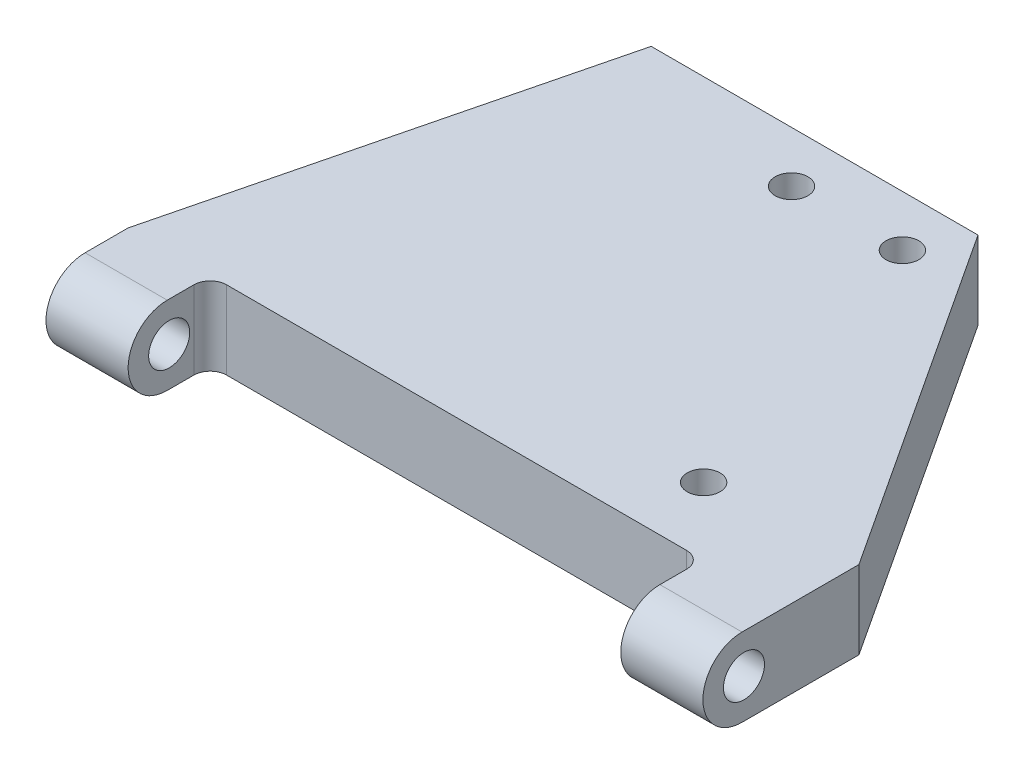
ISO-10303-21;
HEADER;
FILE_DESCRIPTION(('STEP AP214'),'2;1');
FILE_NAME('part.step','',(''),(''),'','','');
FILE_SCHEMA(('AUTOMOTIVE_DESIGN { 1 0 10303 214 1 1 1 1 }'));
ENDSEC;
DATA;
#1=APPLICATION_CONTEXT('core data for automotive mechanical design processes');
#2=APPLICATION_PROTOCOL_DEFINITION('international standard','automotive_design',2000,#1);
#3=PRODUCT_CONTEXT('',#1,'mechanical');
#4=PRODUCT('Part','Part','',(#3));
#5=PRODUCT_RELATED_PRODUCT_CATEGORY('part','',(#4));
#6=PRODUCT_DEFINITION_FORMATION('','',#4);
#7=PRODUCT_DEFINITION_CONTEXT('part definition',#1,'design');
#8=PRODUCT_DEFINITION('design','',#6,#7);
#9=PRODUCT_DEFINITION_SHAPE('','',#8);
#10=(LENGTH_UNIT() NAMED_UNIT(*) SI_UNIT(.MILLI.,.METRE.));
#11=(NAMED_UNIT(*) PLANE_ANGLE_UNIT() SI_UNIT($,.RADIAN.));
#12=(NAMED_UNIT(*) SI_UNIT($,.STERADIAN.) SOLID_ANGLE_UNIT());
#13=UNCERTAINTY_MEASURE_WITH_UNIT(LENGTH_MEASURE(1.E-05),#10,'distance_accuracy_value','');
#14=(GEOMETRIC_REPRESENTATION_CONTEXT(3) GLOBAL_UNCERTAINTY_ASSIGNED_CONTEXT((#13)) GLOBAL_UNIT_ASSIGNED_CONTEXT((#10,
#11,#12)) REPRESENTATION_CONTEXT('',''));
#15=CARTESIAN_POINT('',(0.,0.,0.));
#16=DIRECTION('',(0.,0.,1.));
#17=DIRECTION('',(1.,0.,0.));
#18=AXIS2_PLACEMENT_3D('',#15,#16,#17);
#19=CARTESIAN_POINT('',(140.,9.525,112.475));
#20=DIRECTION('',(1.,0.,0.));
#21=DIRECTION('',(0.,0.,-1.));
#22=AXIS2_PLACEMENT_3D('',#19,#20,#21);
#23=CYLINDRICAL_SURFACE('',#22,9.525);
#24=DIRECTION('',(-1.,0.,0.));
#25=VECTOR('',#24,1.);
#26=CARTESIAN_POINT('',(140.,19.05,112.475));
#27=LINE('',#26,#25);
#28=CARTESIAN_POINT('',(140.,19.05,112.475));
#29=VERTEX_POINT('',#28);
#30=CARTESIAN_POINT('',(160.,19.05,112.475));
#31=VERTEX_POINT('',#30);
#32=EDGE_CURVE('E293',#29,#31,#27,.F.);
#33=ORIENTED_EDGE('',*,*,#32,.F.);
#34=CARTESIAN_POINT('',(140.,9.525,112.475));
#35=DIRECTION('',(1.,0.,0.));
#36=DIRECTION('',(0.,0.,-1.));
#37=AXIS2_PLACEMENT_3D('',#34,#35,#36);
#38=CIRCLE('',#37,9.525);
#39=CARTESIAN_POINT('',(140.,0.,112.475));
#40=VERTEX_POINT('',#39);
#41=EDGE_CURVE('E118',#40,#29,#38,.F.);
#42=ORIENTED_EDGE('',*,*,#41,.F.);
#43=DIRECTION('',(1.,0.,0.));
#44=VECTOR('',#43,1.);
#45=CARTESIAN_POINT('',(0.,0.,112.475));
#46=LINE('',#45,#44);
#47=CARTESIAN_POINT('',(160.,0.,112.475));
#48=VERTEX_POINT('',#47);
#49=EDGE_CURVE('E296',#48,#40,#46,.F.);
#50=ORIENTED_EDGE('',*,*,#49,.F.);
#51=CARTESIAN_POINT('',(160.,9.525,112.475));
#52=DIRECTION('',(-1.,0.,0.));
#53=DIRECTION('',(0.,0.,1.));
#54=AXIS2_PLACEMENT_3D('',#51,#52,#53);
#55=CIRCLE('',#54,9.525);
#56=EDGE_CURVE('E12',#31,#48,#55,.F.);
#57=ORIENTED_EDGE('',*,*,#56,.F.);
#58=EDGE_LOOP('',(#33,#42,#50,#57));
#59=FACE_BOUND('',#58,.T.);
#60=ADVANCED_FACE('F110',(#59),#23,.T.);
#61=CARTESIAN_POINT('',(0.,9.525,112.475));
#62=DIRECTION('',(1.,0.,0.));
#63=DIRECTION('',(0.,0.,-1.));
#64=AXIS2_PLACEMENT_3D('',#61,#62,#63);
#65=CYLINDRICAL_SURFACE('',#64,9.525);
#66=DIRECTION('',(-1.,0.,0.));
#67=VECTOR('',#66,1.);
#68=CARTESIAN_POINT('',(0.,19.05,112.475));
#69=LINE('',#68,#67);
#70=CARTESIAN_POINT('',(0.,19.05,112.475));
#71=VERTEX_POINT('',#70);
#72=CARTESIAN_POINT('',(20.,19.05,112.475));
#73=VERTEX_POINT('',#72);
#74=EDGE_CURVE('E207',#71,#73,#69,.F.);
#75=ORIENTED_EDGE('',*,*,#74,.F.);
#76=CARTESIAN_POINT('',(0.,9.525,112.475));
#77=DIRECTION('',(1.,0.,0.));
#78=DIRECTION('',(0.,0.,-1.));
#79=AXIS2_PLACEMENT_3D('',#76,#77,#78);
#80=CIRCLE('',#79,9.525);
#81=CARTESIAN_POINT('',(0.,0.,112.475));
#82=VERTEX_POINT('',#81);
#83=EDGE_CURVE('E289',#82,#71,#80,.F.);
#84=ORIENTED_EDGE('',*,*,#83,.F.);
#85=DIRECTION('',(1.,0.,0.));
#86=VECTOR('',#85,1.);
#87=CARTESIAN_POINT('',(0.,0.,112.475));
#88=LINE('',#87,#86);
#89=CARTESIAN_POINT('',(20.,0.,112.475));
#90=VERTEX_POINT('',#89);
#91=EDGE_CURVE('E286',#90,#82,#88,.F.);
#92=ORIENTED_EDGE('',*,*,#91,.F.);
#93=CARTESIAN_POINT('',(20.,9.525,112.475));
#94=DIRECTION('',(1.,0.,0.));
#95=DIRECTION('',(0.,0.,-1.));
#96=AXIS2_PLACEMENT_3D('',#93,#94,#95);
#97=CIRCLE('',#96,9.525);
#98=EDGE_CURVE('E291',#73,#90,#97,.T.);
#99=ORIENTED_EDGE('',*,*,#98,.F.);
#100=EDGE_LOOP('',(#75,#84,#92,#99));
#101=FACE_BOUND('',#100,.T.);
#102=ADVANCED_FACE('F331',(#101),#65,.T.);
#103=CARTESIAN_POINT('',(0.,0.,0.));
#104=DIRECTION('',(0.,1.,0.));
#105=DIRECTION('',(0.,0.,1.));
#106=AXIS2_PLACEMENT_3D('',#103,#104,#105);
#107=PLANE('',#106);
#108=CARTESIAN_POINT('',(123.750569229122,0.,85.5773374277373));
#109=DIRECTION('',(0.,1.,0.));
#110=DIRECTION('',(0.,0.,1.));
#111=AXIS2_PLACEMENT_3D('',#108,#109,#110);
#112=CIRCLE('',#111,3.99999999999995);
#113=CARTESIAN_POINT('',(123.750569229122,0.,89.5773374277373));
#114=VERTEX_POINT('',#113);
#115=EDGE_CURVE('E436',#114,#114,#112,.T.);
#116=ORIENTED_EDGE('',*,*,#115,.T.);
#117=EDGE_LOOP('',(#116));
#118=FACE_BOUND('',#117,.T.);
#119=CARTESIAN_POINT('',(72.,0.,12.4141568321594));
#120=DIRECTION('',(0.,-1.,0.));
#121=DIRECTION('',(0.,0.,-1.));
#122=AXIS2_PLACEMENT_3D('',#119,#120,#121);
#123=CIRCLE('',#122,4.00000000000001);
#124=CARTESIAN_POINT('',(72.,0.,8.41415683215943));
#125=VERTEX_POINT('',#124);
#126=EDGE_CURVE('E445',#125,#125,#123,.T.);
#127=ORIENTED_EDGE('',*,*,#126,.F.);
#128=EDGE_LOOP('',(#127));
#129=FACE_BOUND('',#128,.T.);
#130=CARTESIAN_POINT('',(99.,0.,12.4141568321594));
#131=DIRECTION('',(0.,-1.,0.));
#132=DIRECTION('',(0.,0.,-1.));
#133=AXIS2_PLACEMENT_3D('',#130,#131,#132);
#134=CIRCLE('',#133,4.00000000000001);
#135=CARTESIAN_POINT('',(99.,0.,8.41415683215943));
#136=VERTEX_POINT('',#135);
#137=EDGE_CURVE('E395',#136,#136,#134,.T.);
#138=ORIENTED_EDGE('',*,*,#137,.F.);
#139=EDGE_LOOP('',(#138));
#140=FACE_BOUND('',#139,.T.);
#141=DIRECTION('',(0.,0.,-1.));
#142=VECTOR('',#141,1.);
#143=CARTESIAN_POINT('',(160.,0.,1.1686558153949E-13));
#144=LINE('',#143,#142);
#145=CARTESIAN_POINT('',(160.,0.,84.));
#146=VERTEX_POINT('',#145);
#147=EDGE_CURVE('E255',#48,#146,#144,.T.);
#148=ORIENTED_EDGE('',*,*,#147,.F.);
#149=ORIENTED_EDGE('',*,*,#49,.T.);
#150=DIRECTION('',(0.,0.,1.));
#151=VECTOR('',#150,1.);
#152=CARTESIAN_POINT('',(140.,0.,2.42861286636753E-13));
#153=LINE('',#152,#151);
#154=CARTESIAN_POINT('',(140.,0.,106.));
#155=VERTEX_POINT('',#154);
#156=EDGE_CURVE('E252',#155,#40,#153,.T.);
#157=ORIENTED_EDGE('',*,*,#156,.F.);
#158=CARTESIAN_POINT('',(136.,0.,106.));
#159=DIRECTION('',(0.,1.,0.));
#160=DIRECTION('',(0.,0.,1.));
#161=AXIS2_PLACEMENT_3D('',#158,#159,#160);
#162=CIRCLE('',#161,4.00000000000001);
#163=CARTESIAN_POINT('',(136.,0.,102.));
#164=VERTEX_POINT('',#163);
#165=EDGE_CURVE('E249',#164,#155,#162,.F.);
#166=ORIENTED_EDGE('',*,*,#165,.F.);
#167=DIRECTION('',(-1.,0.,0.));
#168=VECTOR('',#167,1.);
#169=CARTESIAN_POINT('',(0.,0.,102.));
#170=LINE('',#169,#168);
#171=CARTESIAN_POINT('',(24.,0.,102.));
#172=VERTEX_POINT('',#171);
#173=EDGE_CURVE('E246',#164,#172,#170,.T.);
#174=ORIENTED_EDGE('',*,*,#173,.T.);
#175=CARTESIAN_POINT('',(24.,0.,106.));
#176=DIRECTION('',(0.,1.,0.));
#177=DIRECTION('',(0.,0.,1.));
#178=AXIS2_PLACEMENT_3D('',#175,#176,#177);
#179=CIRCLE('',#178,4.00000000000001);
#180=CARTESIAN_POINT('',(20.,0.,106.));
#181=VERTEX_POINT('',#180);
#182=EDGE_CURVE('E202',#172,#181,#179,.T.);
#183=ORIENTED_EDGE('',*,*,#182,.T.);
#184=DIRECTION('',(0.,0.,1.));
#185=VECTOR('',#184,1.);
#186=CARTESIAN_POINT('',(20.,0.,0.));
#187=LINE('',#186,#185);
#188=EDGE_CURVE('E219',#181,#90,#187,.T.);
#189=ORIENTED_EDGE('',*,*,#188,.T.);
#190=ORIENTED_EDGE('',*,*,#91,.T.);
#191=DIRECTION('',(0.,0.,1.));
#192=VECTOR('',#191,1.);
#193=CARTESIAN_POINT('',(0.,0.,0.));
#194=LINE('',#193,#192);
#195=CARTESIAN_POINT('',(0.,0.,102.));
#196=VERTEX_POINT('',#195);
#197=EDGE_CURVE('E266',#196,#82,#194,.T.);
#198=ORIENTED_EDGE('',*,*,#197,.F.);
#199=DIRECTION('',(0.241640143717287,0.,-0.97036593146312));
#200=VECTOR('',#199,1.);
#201=CARTESIAN_POINT('',(23.9168950399849,0.,5.95577582368252));
#202=LINE('',#201,#200);
#203=CARTESIAN_POINT('',(25.4,0.,0.));
#204=VERTEX_POINT('',#203);
#205=EDGE_CURVE('E263',#196,#204,#202,.T.);
#206=ORIENTED_EDGE('',*,*,#205,.T.);
#207=DIRECTION('',(-1.,0.,0.));
#208=VECTOR('',#207,1.);
#209=CARTESIAN_POINT('',(0.,0.,0.));
#210=LINE('',#209,#208);
#211=CARTESIAN_POINT('',(105.,0.,0.));
#212=VERTEX_POINT('',#211);
#213=EDGE_CURVE('E260',#212,#204,#210,.T.);
#214=ORIENTED_EDGE('',*,*,#213,.F.);
#215=DIRECTION('',(0.547785941363776,0.,0.836618528628312));
#216=VECTOR('',#215,1.);
#217=CARTESIAN_POINT('',(73.4927090566412,0.,-48.1202261680389));
#218=LINE('',#217,#216);
#219=EDGE_CURVE('E257',#212,#146,#218,.T.);
#220=ORIENTED_EDGE('',*,*,#219,.T.);
#221=EDGE_LOOP('',(#148,#149,#157,#166,#174,#183,#189,#190,#198,#206,#214,#220));
#222=FACE_BOUND('',#221,.T.);
#223=ADVANCED_FACE('F305',(#118,#129,#140,#222),#107,.F.);
#224=CARTESIAN_POINT('',(140.,19.05,2.42861286636753E-13));
#225=DIRECTION('',(1.,0.,0.));
#226=DIRECTION('',(0.,0.,-1.));
#227=AXIS2_PLACEMENT_3D('',#224,#225,#226);
#228=PLANE('',#227);
#229=CARTESIAN_POINT('',(140.,9.525,112.));
#230=DIRECTION('',(1.,0.,0.));
#231=DIRECTION('',(0.,0.,-1.));
#232=AXIS2_PLACEMENT_3D('',#229,#230,#231);
#233=CIRCLE('',#232,5.);
#234=CARTESIAN_POINT('',(140.,9.525,107.));
#235=VERTEX_POINT('',#234);
#236=EDGE_CURVE('E389',#235,#235,#233,.T.);
#237=ORIENTED_EDGE('',*,*,#236,.T.);
#238=EDGE_LOOP('',(#237));
#239=FACE_BOUND('',#238,.T.);
#240=ORIENTED_EDGE('',*,*,#156,.T.);
#241=ORIENTED_EDGE('',*,*,#41,.T.);
#242=DIRECTION('',(0.,0.,1.));
#243=VECTOR('',#242,1.);
#244=CARTESIAN_POINT('',(140.,19.05,2.42861286636753E-13));
#245=LINE('',#244,#243);
#246=CARTESIAN_POINT('',(140.,19.05,106.));
#247=VERTEX_POINT('',#246);
#248=EDGE_CURVE('E225',#247,#29,#245,.T.);
#249=ORIENTED_EDGE('',*,*,#248,.F.);
#250=DIRECTION('',(0.,-1.,0.));
#251=VECTOR('',#250,1.);
#252=CARTESIAN_POINT('',(140.,19.05,106.));
#253=LINE('',#252,#251);
#254=EDGE_CURVE('E281',#247,#155,#253,.T.);
#255=ORIENTED_EDGE('',*,*,#254,.T.);
#256=EDGE_LOOP('',(#240,#241,#249,#255));
#257=FACE_BOUND('',#256,.T.);
#258=ADVANCED_FACE('F298',(#239,#257),#228,.F.);
#259=CARTESIAN_POINT('',(136.,19.05,106.));
#260=DIRECTION('',(0.,-1.,0.));
#261=DIRECTION('',(0.,0.,-1.));
#262=AXIS2_PLACEMENT_3D('',#259,#260,#261);
#263=CYLINDRICAL_SURFACE('',#262,4.00000000000001);
#264=ORIENTED_EDGE('',*,*,#165,.T.);
#265=ORIENTED_EDGE('',*,*,#254,.F.);
#266=CARTESIAN_POINT('',(136.,19.05,106.));
#267=DIRECTION('',(0.,1.,0.));
#268=DIRECTION('',(0.,0.,1.));
#269=AXIS2_PLACEMENT_3D('',#266,#267,#268);
#270=CIRCLE('',#269,4.00000000000001);
#271=CARTESIAN_POINT('',(136.,19.05,102.));
#272=VERTEX_POINT('',#271);
#273=EDGE_CURVE('E223',#272,#247,#270,.F.);
#274=ORIENTED_EDGE('',*,*,#273,.F.);
#275=DIRECTION('',(0.,-1.,0.));
#276=VECTOR('',#275,1.);
#277=CARTESIAN_POINT('',(136.,19.05,102.));
#278=LINE('',#277,#276);
#279=EDGE_CURVE('E208',#272,#164,#278,.T.);
#280=ORIENTED_EDGE('',*,*,#279,.T.);
#281=EDGE_LOOP('',(#264,#265,#274,#280));
#282=FACE_BOUND('',#281,.T.);
#283=ADVANCED_FACE('F301',(#282),#263,.F.);
#284=CARTESIAN_POINT('',(0.,19.05,102.));
#285=DIRECTION('',(0.,0.,1.));
#286=DIRECTION('',(1.,0.,0.));
#287=AXIS2_PLACEMENT_3D('',#284,#285,#286);
#288=PLANE('',#287);
#289=ORIENTED_EDGE('',*,*,#173,.F.);
#290=ORIENTED_EDGE('',*,*,#279,.F.);
#291=DIRECTION('',(-1.,0.,0.));
#292=VECTOR('',#291,1.);
#293=CARTESIAN_POINT('',(0.,19.05,102.));
#294=LINE('',#293,#292);
#295=CARTESIAN_POINT('',(24.,19.05,102.));
#296=VERTEX_POINT('',#295);
#297=EDGE_CURVE('E215',#272,#296,#294,.T.);
#298=ORIENTED_EDGE('',*,*,#297,.T.);
#299=DIRECTION('',(0.,-1.,0.));
#300=VECTOR('',#299,1.);
#301=CARTESIAN_POINT('',(24.,19.05,102.));
#302=LINE('',#301,#300);
#303=EDGE_CURVE('E196',#296,#172,#302,.T.);
#304=ORIENTED_EDGE('',*,*,#303,.T.);
#305=EDGE_LOOP('',(#289,#290,#298,#304));
#306=FACE_BOUND('',#305,.T.);
#307=ADVANCED_FACE('F221',(#306),#288,.T.);
#308=CARTESIAN_POINT('',(24.,19.05,106.));
#309=DIRECTION('',(0.,-1.,0.));
#310=DIRECTION('',(0.,0.,-1.));
#311=AXIS2_PLACEMENT_3D('',#308,#309,#310);
#312=CYLINDRICAL_SURFACE('',#311,4.00000000000001);
#313=ORIENTED_EDGE('',*,*,#182,.F.);
#314=ORIENTED_EDGE('',*,*,#303,.F.);
#315=CARTESIAN_POINT('',(24.,19.05,106.));
#316=DIRECTION('',(0.,1.,0.));
#317=DIRECTION('',(0.,0.,1.));
#318=AXIS2_PLACEMENT_3D('',#315,#316,#317);
#319=CIRCLE('',#318,4.00000000000001);
#320=CARTESIAN_POINT('',(20.,19.05,106.));
#321=VERTEX_POINT('',#320);
#322=EDGE_CURVE('E199',#296,#321,#319,.T.);
#323=ORIENTED_EDGE('',*,*,#322,.T.);
#324=DIRECTION('',(0.,-1.,0.));
#325=VECTOR('',#324,1.);
#326=CARTESIAN_POINT('',(20.,19.05,106.));
#327=LINE('',#326,#325);
#328=EDGE_CURVE('E244',#321,#181,#327,.T.);
#329=ORIENTED_EDGE('',*,*,#328,.T.);
#330=EDGE_LOOP('',(#313,#314,#323,#329));
#331=FACE_BOUND('',#330,.T.);
#332=ADVANCED_FACE('F198',(#331),#312,.F.);
#333=CARTESIAN_POINT('',(20.,19.05,0.));
#334=DIRECTION('',(1.,0.,0.));
#335=DIRECTION('',(0.,0.,-1.));
#336=AXIS2_PLACEMENT_3D('',#333,#334,#335);
#337=PLANE('',#336);
#338=CARTESIAN_POINT('',(20.,9.525,112.));
#339=DIRECTION('',(1.,0.,0.));
#340=DIRECTION('',(0.,0.,-1.));
#341=AXIS2_PLACEMENT_3D('',#338,#339,#340);
#342=CIRCLE('',#341,5.);
#343=CARTESIAN_POINT('',(20.,9.525,107.));
#344=VERTEX_POINT('',#343);
#345=EDGE_CURVE('E385',#344,#344,#342,.T.);
#346=ORIENTED_EDGE('',*,*,#345,.F.);
#347=EDGE_LOOP('',(#346));
#348=FACE_BOUND('',#347,.T.);
#349=DIRECTION('',(0.,0.,1.));
#350=VECTOR('',#349,1.);
#351=CARTESIAN_POINT('',(20.,19.05,0.));
#352=LINE('',#351,#350);
#353=EDGE_CURVE('E218',#321,#73,#352,.T.);
#354=ORIENTED_EDGE('',*,*,#353,.T.);
#355=ORIENTED_EDGE('',*,*,#98,.T.);
#356=ORIENTED_EDGE('',*,*,#188,.F.);
#357=ORIENTED_EDGE('',*,*,#328,.F.);
#358=EDGE_LOOP('',(#354,#355,#356,#357));
#359=FACE_BOUND('',#358,.T.);
#360=ADVANCED_FACE('F328',(#348,#359),#337,.T.);
#361=CARTESIAN_POINT('',(0.,19.05,0.));
#362=DIRECTION('',(1.,0.,0.));
#363=DIRECTION('',(0.,0.,-1.));
#364=AXIS2_PLACEMENT_3D('',#361,#362,#363);
#365=PLANE('',#364);
#366=CARTESIAN_POINT('',(0.,9.525,112.));
#367=DIRECTION('',(-1.,0.,0.));
#368=DIRECTION('',(0.,0.,1.));
#369=AXIS2_PLACEMENT_3D('',#366,#367,#368);
#370=CIRCLE('',#369,5.);
#371=CARTESIAN_POINT('',(0.,9.525,117.));
#372=VERTEX_POINT('',#371);
#373=EDGE_CURVE('E386',#372,#372,#370,.T.);
#374=ORIENTED_EDGE('',*,*,#373,.F.);
#375=EDGE_LOOP('',(#374));
#376=FACE_BOUND('',#375,.T.);
#377=ORIENTED_EDGE('',*,*,#197,.T.);
#378=ORIENTED_EDGE('',*,*,#83,.T.);
#379=DIRECTION('',(0.,0.,1.));
#380=VECTOR('',#379,1.);
#381=CARTESIAN_POINT('',(0.,19.05,0.));
#382=LINE('',#381,#380);
#383=CARTESIAN_POINT('',(0.,19.05,102.));
#384=VERTEX_POINT('',#383);
#385=EDGE_CURVE('E240',#384,#71,#382,.T.);
#386=ORIENTED_EDGE('',*,*,#385,.F.);
#387=DIRECTION('',(0.,-1.,0.));
#388=VECTOR('',#387,1.);
#389=CARTESIAN_POINT('',(0.,19.05,102.));
#390=LINE('',#389,#388);
#391=EDGE_CURVE('E272',#384,#196,#390,.T.);
#392=ORIENTED_EDGE('',*,*,#391,.T.);
#393=EDGE_LOOP('',(#377,#378,#386,#392));
#394=FACE_BOUND('',#393,.T.);
#395=ADVANCED_FACE('F324',(#376,#394),#365,.F.);
#396=CARTESIAN_POINT('',(23.9168950399849,19.05,5.95577582368252));
#397=DIRECTION('',(-0.97036593146312,0.,-0.241640143717287));
#398=DIRECTION('',(-0.241640143717287,0.,0.97036593146312));
#399=AXIS2_PLACEMENT_3D('',#396,#397,#398);
#400=PLANE('',#399);
#401=ORIENTED_EDGE('',*,*,#205,.F.);
#402=ORIENTED_EDGE('',*,*,#391,.F.);
#403=DIRECTION('',(0.241640143717287,0.,-0.97036593146312));
#404=VECTOR('',#403,1.);
#405=CARTESIAN_POINT('',(23.9168950399849,19.05,5.95577582368252));
#406=LINE('',#405,#404);
#407=CARTESIAN_POINT('',(25.4,19.05,0.));
#408=VERTEX_POINT('',#407);
#409=EDGE_CURVE('E237',#384,#408,#406,.T.);
#410=ORIENTED_EDGE('',*,*,#409,.T.);
#411=DIRECTION('',(0.,-1.,0.));
#412=VECTOR('',#411,1.);
#413=CARTESIAN_POINT('',(25.4,19.05,0.));
#414=LINE('',#413,#412);
#415=EDGE_CURVE('E274',#408,#204,#414,.T.);
#416=ORIENTED_EDGE('',*,*,#415,.T.);
#417=EDGE_LOOP('',(#401,#402,#410,#416));
#418=FACE_BOUND('',#417,.T.);
#419=ADVANCED_FACE('F320',(#418),#400,.T.);
#420=CARTESIAN_POINT('',(0.,19.05,0.));
#421=DIRECTION('',(0.,0.,1.));
#422=DIRECTION('',(1.,0.,0.));
#423=AXIS2_PLACEMENT_3D('',#420,#421,#422);
#424=PLANE('',#423);
#425=CARTESIAN_POINT('',(34.925,9.525,0.));
#426=DIRECTION('',(0.,0.,-1.));
#427=DIRECTION('',(-1.,0.,0.));
#428=AXIS2_PLACEMENT_3D('',#425,#426,#427);
#429=CIRCLE('',#428,3.96875);
#430=CARTESIAN_POINT('',(30.95625,9.525,0.));
#431=VERTEX_POINT('',#430);
#432=EDGE_CURVE('E399',#431,#431,#429,.T.);
#433=ORIENTED_EDGE('',*,*,#432,.F.);
#434=EDGE_LOOP('',(#433));
#435=FACE_BOUND('',#434,.T.);
#436=ORIENTED_EDGE('',*,*,#213,.T.);
#437=ORIENTED_EDGE('',*,*,#415,.F.);
#438=DIRECTION('',(-1.,0.,0.));
#439=VECTOR('',#438,1.);
#440=CARTESIAN_POINT('',(0.,19.05,0.));
#441=LINE('',#440,#439);
#442=CARTESIAN_POINT('',(105.,19.05,0.));
#443=VERTEX_POINT('',#442);
#444=EDGE_CURVE('E235',#443,#408,#441,.T.);
#445=ORIENTED_EDGE('',*,*,#444,.F.);
#446=DIRECTION('',(0.,-1.,0.));
#447=VECTOR('',#446,1.);
#448=CARTESIAN_POINT('',(105.,19.05,0.));
#449=LINE('',#448,#447);
#450=EDGE_CURVE('E276',#443,#212,#449,.T.);
#451=ORIENTED_EDGE('',*,*,#450,.T.);
#452=EDGE_LOOP('',(#436,#437,#445,#451));
#453=FACE_BOUND('',#452,.T.);
#454=ADVANCED_FACE('F317',(#435,#453),#424,.F.);
#455=CARTESIAN_POINT('',(73.4927090566412,19.05,-48.1202261680389));
#456=DIRECTION('',(0.836618528628312,0.,-0.547785941363776));
#457=DIRECTION('',(-0.547785941363776,0.,-0.836618528628312));
#458=AXIS2_PLACEMENT_3D('',#455,#456,#457);
#459=PLANE('',#458);
#460=ORIENTED_EDGE('',*,*,#219,.F.);
#461=ORIENTED_EDGE('',*,*,#450,.F.);
#462=DIRECTION('',(0.547785941363776,0.,0.836618528628312));
#463=VECTOR('',#462,1.);
#464=CARTESIAN_POINT('',(73.4927090566412,19.05,-48.1202261680389));
#465=LINE('',#464,#463);
#466=CARTESIAN_POINT('',(160.,19.05,84.));
#467=VERTEX_POINT('',#466);
#468=EDGE_CURVE('E232',#443,#467,#465,.T.);
#469=ORIENTED_EDGE('',*,*,#468,.T.);
#470=DIRECTION('',(0.,-1.,0.));
#471=VECTOR('',#470,1.);
#472=CARTESIAN_POINT('',(160.,19.05,84.));
#473=LINE('',#472,#471);
#474=EDGE_CURVE('E278',#467,#146,#473,.T.);
#475=ORIENTED_EDGE('',*,*,#474,.T.);
#476=EDGE_LOOP('',(#460,#461,#469,#475));
#477=FACE_BOUND('',#476,.T.);
#478=ADVANCED_FACE('F311',(#477),#459,.T.);
#479=CARTESIAN_POINT('',(160.,19.05,1.1686558153949E-13));
#480=DIRECTION('',(-1.,0.,0.));
#481=DIRECTION('',(0.,0.,1.));
#482=AXIS2_PLACEMENT_3D('',#479,#480,#481);
#483=PLANE('',#482);
#484=CARTESIAN_POINT('',(160.,9.525,112.));
#485=DIRECTION('',(-1.,0.,0.));
#486=DIRECTION('',(0.,0.,1.));
#487=AXIS2_PLACEMENT_3D('',#484,#485,#486);
#488=CIRCLE('',#487,5.);
#489=CARTESIAN_POINT('',(160.,9.525,117.));
#490=VERTEX_POINT('',#489);
#491=EDGE_CURVE('E383',#490,#490,#488,.T.);
#492=ORIENTED_EDGE('',*,*,#491,.T.);
#493=EDGE_LOOP('',(#492));
#494=FACE_BOUND('',#493,.T.);
#495=DIRECTION('',(0.,0.,-1.));
#496=VECTOR('',#495,1.);
#497=CARTESIAN_POINT('',(160.,19.05,1.1686558153949E-13));
#498=LINE('',#497,#496);
#499=EDGE_CURVE('E230',#31,#467,#498,.T.);
#500=ORIENTED_EDGE('',*,*,#499,.F.);
#501=ORIENTED_EDGE('',*,*,#56,.T.);
#502=ORIENTED_EDGE('',*,*,#147,.T.);
#503=ORIENTED_EDGE('',*,*,#474,.F.);
#504=EDGE_LOOP('',(#500,#501,#502,#503));
#505=FACE_BOUND('',#504,.T.);
#506=ADVANCED_FACE('F309',(#494,#505),#483,.F.);
#507=CARTESIAN_POINT('',(0.,19.05,0.));
#508=DIRECTION('',(0.,1.,0.));
#509=DIRECTION('',(0.,0.,1.));
#510=AXIS2_PLACEMENT_3D('',#507,#508,#509);
#511=PLANE('',#510);
#512=CARTESIAN_POINT('',(123.750569229122,19.05,85.5773374277373));
#513=DIRECTION('',(0.,1.,0.));
#514=DIRECTION('',(0.,0.,1.));
#515=AXIS2_PLACEMENT_3D('',#512,#513,#514);
#516=CIRCLE('',#515,3.99999999999995);
#517=CARTESIAN_POINT('',(123.750569229122,19.05,89.5773374277373));
#518=VERTEX_POINT('',#517);
#519=EDGE_CURVE('E439',#518,#518,#516,.T.);
#520=ORIENTED_EDGE('',*,*,#519,.F.);
#521=EDGE_LOOP('',(#520));
#522=FACE_BOUND('',#521,.T.);
#523=CARTESIAN_POINT('',(72.,19.05,12.4141568321594));
#524=DIRECTION('',(0.,-1.,0.));
#525=DIRECTION('',(0.,0.,-1.));
#526=AXIS2_PLACEMENT_3D('',#523,#524,#525);
#527=CIRCLE('',#526,4.00000000000001);
#528=CARTESIAN_POINT('',(72.,19.05,8.41415683215943));
#529=VERTEX_POINT('',#528);
#530=EDGE_CURVE('E392',#529,#529,#527,.T.);
#531=ORIENTED_EDGE('',*,*,#530,.T.);
#532=EDGE_LOOP('',(#531));
#533=FACE_BOUND('',#532,.T.);
#534=CARTESIAN_POINT('',(99.,19.05,12.4141568321594));
#535=DIRECTION('',(0.,-1.,0.));
#536=DIRECTION('',(0.,0.,-1.));
#537=AXIS2_PLACEMENT_3D('',#534,#535,#536);
#538=CIRCLE('',#537,4.00000000000001);
#539=CARTESIAN_POINT('',(99.,19.05,8.41415683215943));
#540=VERTEX_POINT('',#539);
#541=EDGE_CURVE('E447',#540,#540,#538,.T.);
#542=ORIENTED_EDGE('',*,*,#541,.T.);
#543=EDGE_LOOP('',(#542));
#544=FACE_BOUND('',#543,.T.);
#545=ORIENTED_EDGE('',*,*,#248,.T.);
#546=ORIENTED_EDGE('',*,*,#32,.T.);
#547=ORIENTED_EDGE('',*,*,#499,.T.);
#548=ORIENTED_EDGE('',*,*,#468,.F.);
#549=ORIENTED_EDGE('',*,*,#444,.T.);
#550=ORIENTED_EDGE('',*,*,#409,.F.);
#551=ORIENTED_EDGE('',*,*,#385,.T.);
#552=ORIENTED_EDGE('',*,*,#74,.T.);
#553=ORIENTED_EDGE('',*,*,#353,.F.);
#554=ORIENTED_EDGE('',*,*,#322,.F.);
#555=ORIENTED_EDGE('',*,*,#297,.F.);
#556=ORIENTED_EDGE('',*,*,#273,.T.);
#557=EDGE_LOOP('',(#545,#546,#547,#548,#549,#550,#551,#552,#553,#554,#555,#556));
#558=FACE_BOUND('',#557,.T.);
#559=ADVANCED_FACE('F213',(#522,#533,#544,#558),#511,.T.);
#560=CARTESIAN_POINT('',(34.925,9.525,38.1));
#561=DIRECTION('',(0.,0.,-1.));
#562=DIRECTION('',(-1.,0.,0.));
#563=AXIS2_PLACEMENT_3D('',#560,#561,#562);
#564=CYLINDRICAL_SURFACE('',#563,3.96875);
#565=CARTESIAN_POINT('',(34.925,9.525,38.1));
#566=DIRECTION('',(0.,0.,-1.));
#567=DIRECTION('',(-1.,0.,0.));
#568=AXIS2_PLACEMENT_3D('',#565,#566,#567);
#569=CIRCLE('',#568,3.96875);
#570=CARTESIAN_POINT('',(30.95625,9.525,38.1));
#571=VERTEX_POINT('',#570);
#572=EDGE_CURVE('E247',#571,#571,#569,.T.);
#573=CARTESIAN_POINT('',(30.95625,9.525,38.1));
#574=CARTESIAN_POINT('',(30.95625,9.525,37.703125));
#575=CARTESIAN_POINT('',(30.95625,9.525,37.30625));
#576=CARTESIAN_POINT('',(30.95625,9.525,36.5125));
#577=CARTESIAN_POINT('',(30.95625,9.525,36.115625));
#578=CARTESIAN_POINT('',(30.95625,9.525,35.321875));
#579=CARTESIAN_POINT('',(30.95625,9.525,34.925));
#580=CARTESIAN_POINT('',(30.95625,9.525,34.13125));
#581=CARTESIAN_POINT('',(30.95625,9.525,33.734375));
#582=CARTESIAN_POINT('',(30.95625,9.525,32.940625));
#583=CARTESIAN_POINT('',(30.95625,9.525,32.54375));
#584=CARTESIAN_POINT('',(30.95625,9.525,31.75));
#585=CARTESIAN_POINT('',(30.95625,9.525,31.353125));
#586=CARTESIAN_POINT('',(30.95625,9.525,30.559375));
#587=CARTESIAN_POINT('',(30.95625,9.525,30.1625));
#588=CARTESIAN_POINT('',(30.95625,9.525,29.36875));
#589=CARTESIAN_POINT('',(30.95625,9.525,28.971875));
#590=CARTESIAN_POINT('',(30.95625,9.525,28.178125));
#591=CARTESIAN_POINT('',(30.95625,9.525,27.78125));
#592=CARTESIAN_POINT('',(30.95625,9.525,26.9875));
#593=CARTESIAN_POINT('',(30.95625,9.525,26.590625));
#594=CARTESIAN_POINT('',(30.95625,9.525,25.796875));
#595=CARTESIAN_POINT('',(30.95625,9.525,25.4));
#596=CARTESIAN_POINT('',(30.95625,9.525,24.60625));
#597=CARTESIAN_POINT('',(30.95625,9.525,24.209375));
#598=CARTESIAN_POINT('',(30.95625,9.525,23.415625));
#599=CARTESIAN_POINT('',(30.95625,9.525,23.01875));
#600=CARTESIAN_POINT('',(30.95625,9.525,22.225));
#601=CARTESIAN_POINT('',(30.95625,9.525,21.828125));
#602=CARTESIAN_POINT('',(30.95625,9.525,21.034375));
#603=CARTESIAN_POINT('',(30.95625,9.525,20.6375));
#604=CARTESIAN_POINT('',(30.95625,9.525,19.84375));
#605=CARTESIAN_POINT('',(30.95625,9.525,19.446875));
#606=CARTESIAN_POINT('',(30.95625,9.525,18.653125));
#607=CARTESIAN_POINT('',(30.95625,9.525,18.25625));
#608=CARTESIAN_POINT('',(30.95625,9.525,17.4625));
#609=CARTESIAN_POINT('',(30.95625,9.525,17.065625));
#610=CARTESIAN_POINT('',(30.95625,9.525,16.271875));
#611=CARTESIAN_POINT('',(30.95625,9.525,15.875));
#612=CARTESIAN_POINT('',(30.95625,9.525,15.08125));
#613=CARTESIAN_POINT('',(30.95625,9.525,14.684375));
#614=CARTESIAN_POINT('',(30.95625,9.525,13.890625));
#615=CARTESIAN_POINT('',(30.95625,9.525,13.49375));
#616=CARTESIAN_POINT('',(30.95625,9.525,12.7));
#617=CARTESIAN_POINT('',(30.95625,9.525,12.303125));
#618=CARTESIAN_POINT('',(30.95625,9.525,11.509375));
#619=CARTESIAN_POINT('',(30.95625,9.525,11.1125));
#620=CARTESIAN_POINT('',(30.95625,9.525,10.31875));
#621=CARTESIAN_POINT('',(30.95625,9.525,9.92187499999999));
#622=CARTESIAN_POINT('',(30.95625,9.525,9.128125));
#623=CARTESIAN_POINT('',(30.95625,9.525,8.73124999999999));
#624=CARTESIAN_POINT('',(30.95625,9.525,7.93749999999999));
#625=CARTESIAN_POINT('',(30.95625,9.525,7.54062499999999));
#626=CARTESIAN_POINT('',(30.95625,9.525,6.74687499999999));
#627=CARTESIAN_POINT('',(30.95625,9.525,6.35));
#628=CARTESIAN_POINT('',(30.95625,9.525,5.55625));
#629=CARTESIAN_POINT('',(30.95625,9.525,5.159375));
#630=CARTESIAN_POINT('',(30.95625,9.525,4.365625));
#631=CARTESIAN_POINT('',(30.95625,9.525,3.96875));
#632=CARTESIAN_POINT('',(30.95625,9.525,3.17499999999999));
#633=CARTESIAN_POINT('',(30.95625,9.525,2.77812499999999));
#634=CARTESIAN_POINT('',(30.95625,9.525,1.98437499999999));
#635=CARTESIAN_POINT('',(30.95625,9.525,1.58749999999999));
#636=CARTESIAN_POINT('',(30.95625,9.525,0.793749999999994));
#637=CARTESIAN_POINT('',(30.95625,9.525,0.396874999999993));
#638=CARTESIAN_POINT('',(30.95625,9.525,0.));
#639=B_SPLINE_CURVE_WITH_KNOTS('',3,(#573,#574,#575,#576,#577,#578,#579,#580,#581,#582,#583,
#584,#585,#586,#587,#588,#589,#590,#591,#592,#593,#594,#595,#596,#597,#598,#599,#600,#601,#602,
#603,#604,#605,#606,#607,#608,#609,#610,#611,#612,#613,#614,#615,#616,#617,#618,#619,#620,#621,
#622,#623,#624,#625,#626,#627,#628,#629,#630,#631,#632,#633,#634,#635,#636,#637,#638),
.UNSPECIFIED.,.F.,.F.,(4,2,2,2,2,2,2,2,2,2,2,2,2,2,2,2,2,2,2,2,2,2,2,2,2,2,2,2,2,2,2,2,4),(0.,
1.19062499999999,2.38124999999999,3.571875,4.7625,5.953125,7.14375,8.334375,9.525,10.715625,
11.90625,13.096875,14.2875,15.478125,16.66875,17.859375,19.05,20.240625,21.43125,22.621875,
23.8125,25.003125,26.19375,27.384375,28.575,29.765625,30.95625,32.146875,33.3375,34.528125,
35.71875,36.909375,38.1),.UNSPECIFIED.);
#640=EDGE_CURVE('BSEAM379',#571,#431,#639,.T.);
#641=ORIENTED_EDGE('',*,*,#572,.F.);
#642=ORIENTED_EDGE('',*,*,#432,.T.);
#643=ORIENTED_EDGE('',*,*,#640,.T.);
#644=ORIENTED_EDGE('',*,*,#640,.F.);
#645=EDGE_LOOP('',(#641,#643,#642,#644));
#646=FACE_BOUND('',#645,.T.);
#647=ADVANCED_FACE('F379',(#646),#564,.F.);
#648=CARTESIAN_POINT('',(34.925,9.525,38.1));
#649=DIRECTION('',(0.,0.,-1.));
#650=DIRECTION('',(-1.,0.,0.));
#651=AXIS2_PLACEMENT_3D('',#648,#649,#650);
#652=PLANE('',#651);
#653=ORIENTED_EDGE('',*,*,#572,.T.);
#654=EDGE_LOOP('',(#653));
#655=FACE_BOUND('',#654,.T.);
#656=ADVANCED_FACE('F405',(#655),#652,.T.);
#657=CARTESIAN_POINT('',(160.,9.525,112.));
#658=DIRECTION('',(-1.,0.,0.));
#659=DIRECTION('',(0.,0.,1.));
#660=AXIS2_PLACEMENT_3D('',#657,#658,#659);
#661=CYLINDRICAL_SURFACE('',#660,5.);
#662=ORIENTED_EDGE('',*,*,#491,.F.);
#663=EDGE_LOOP('',(#662));
#664=FACE_BOUND('',#663,.T.);
#665=ORIENTED_EDGE('',*,*,#236,.F.);
#666=EDGE_LOOP('',(#665));
#667=FACE_BOUND('',#666,.T.);
#668=ADVANCED_FACE('F411',(#664,#667),#661,.F.);
#669=ORIENTED_EDGE('',*,*,#345,.T.);
#670=EDGE_LOOP('',(#669));
#671=FACE_BOUND('',#670,.T.);
#672=ORIENTED_EDGE('',*,*,#373,.T.);
#673=EDGE_LOOP('',(#672));
#674=FACE_BOUND('',#673,.T.);
#675=ADVANCED_FACE('F416',(#671,#674),#661,.F.);
#676=CARTESIAN_POINT('',(99.,19.05,12.4141568321594));
#677=DIRECTION('',(0.,-1.,0.));
#678=DIRECTION('',(0.,0.,-1.));
#679=AXIS2_PLACEMENT_3D('',#676,#677,#678);
#680=CYLINDRICAL_SURFACE('',#679,4.00000000000001);
#681=CARTESIAN_POINT('',(99.,19.05,8.41415683215943));
#682=CARTESIAN_POINT('',(99.,18.8515625,8.41415683215943));
#683=CARTESIAN_POINT('',(99.,18.653125,8.41415683215943));
#684=CARTESIAN_POINT('',(99.,18.25625,8.41415683215943));
#685=CARTESIAN_POINT('',(99.,18.0578125,8.41415683215943));
#686=CARTESIAN_POINT('',(99.,17.6609375,8.41415683215943));
#687=CARTESIAN_POINT('',(99.,17.4625,8.41415683215943));
#688=CARTESIAN_POINT('',(99.,17.065625,8.41415683215943));
#689=CARTESIAN_POINT('',(99.,16.8671875,8.41415683215943));
#690=CARTESIAN_POINT('',(99.,16.4703125,8.41415683215943));
#691=CARTESIAN_POINT('',(99.,16.271875,8.41415683215943));
#692=CARTESIAN_POINT('',(99.,15.875,8.41415683215943));
#693=CARTESIAN_POINT('',(99.,15.6765625,8.41415683215943));
#694=CARTESIAN_POINT('',(99.,15.2796875,8.41415683215943));
#695=CARTESIAN_POINT('',(99.,15.08125,8.41415683215943));
#696=CARTESIAN_POINT('',(99.,14.684375,8.41415683215943));
#697=CARTESIAN_POINT('',(99.,14.4859375,8.41415683215943));
#698=CARTESIAN_POINT('',(99.,14.0890625,8.41415683215943));
#699=CARTESIAN_POINT('',(99.,13.890625,8.41415683215943));
#700=CARTESIAN_POINT('',(99.,13.49375,8.41415683215943));
#701=CARTESIAN_POINT('',(99.,13.2953125,8.41415683215943));
#702=CARTESIAN_POINT('',(99.,12.8984375,8.41415683215943));
#703=CARTESIAN_POINT('',(99.,12.7,8.41415683215943));
#704=CARTESIAN_POINT('',(99.,12.303125,8.41415683215943));
#705=CARTESIAN_POINT('',(99.,12.1046875,8.41415683215943));
#706=CARTESIAN_POINT('',(99.,11.7078125,8.41415683215943));
#707=CARTESIAN_POINT('',(99.,11.509375,8.41415683215943));
#708=CARTESIAN_POINT('',(99.,11.1125,8.41415683215943));
#709=CARTESIAN_POINT('',(99.,10.9140625,8.41415683215943));
#710=CARTESIAN_POINT('',(99.,10.5171875,8.41415683215943));
#711=CARTESIAN_POINT('',(99.,10.31875,8.41415683215943));
#712=CARTESIAN_POINT('',(99.,9.921875,8.41415683215943));
#713=CARTESIAN_POINT('',(99.,9.7234375,8.41415683215943));
#714=CARTESIAN_POINT('',(99.,9.3265625,8.41415683215943));
#715=CARTESIAN_POINT('',(99.,9.128125,8.41415683215943));
#716=CARTESIAN_POINT('',(99.,8.73125,8.41415683215943));
#717=CARTESIAN_POINT('',(99.,8.5328125,8.41415683215943));
#718=CARTESIAN_POINT('',(99.,8.1359375,8.41415683215943));
#719=CARTESIAN_POINT('',(99.,7.9375,8.41415683215943));
#720=CARTESIAN_POINT('',(99.,7.540625,8.41415683215943));
#721=CARTESIAN_POINT('',(99.,7.3421875,8.41415683215943));
#722=CARTESIAN_POINT('',(99.,6.9453125,8.41415683215943));
#723=CARTESIAN_POINT('',(99.,6.746875,8.41415683215943));
#724=CARTESIAN_POINT('',(99.,6.35,8.41415683215943));
#725=CARTESIAN_POINT('',(99.,6.1515625,8.41415683215943));
#726=CARTESIAN_POINT('',(99.,5.7546875,8.41415683215943));
#727=CARTESIAN_POINT('',(99.,5.55625,8.41415683215943));
#728=CARTESIAN_POINT('',(99.,5.159375,8.41415683215943));
#729=CARTESIAN_POINT('',(99.,4.9609375,8.41415683215943));
#730=CARTESIAN_POINT('',(99.,4.5640625,8.41415683215943));
#731=CARTESIAN_POINT('',(99.,4.365625,8.41415683215943));
#732=CARTESIAN_POINT('',(99.,3.96875,8.41415683215943));
#733=CARTESIAN_POINT('',(99.,3.7703125,8.41415683215943));
#734=CARTESIAN_POINT('',(99.,3.3734375,8.41415683215943));
#735=CARTESIAN_POINT('',(99.,3.175,8.41415683215943));
#736=CARTESIAN_POINT('',(99.,2.778125,8.41415683215943));
#737=CARTESIAN_POINT('',(99.,2.5796875,8.41415683215943));
#738=CARTESIAN_POINT('',(99.,2.1828125,8.41415683215943));
#739=CARTESIAN_POINT('',(99.,1.984375,8.41415683215943));
#740=CARTESIAN_POINT('',(99.,1.5875,8.41415683215943));
#741=CARTESIAN_POINT('',(99.,1.3890625,8.41415683215943));
#742=CARTESIAN_POINT('',(99.,0.992187500000001,8.41415683215943));
#743=CARTESIAN_POINT('',(99.,0.793750000000001,8.41415683215943));
#744=CARTESIAN_POINT('',(99.,0.396875,8.41415683215943));
#745=CARTESIAN_POINT('',(99.,0.1984375,8.41415683215943));
#746=CARTESIAN_POINT('',(99.,0.,8.41415683215943));
#747=B_SPLINE_CURVE_WITH_KNOTS('',3,(#681,#682,#683,#684,#685,#686,#687,#688,#689,#690,#691,
#692,#693,#694,#695,#696,#697,#698,#699,#700,#701,#702,#703,#704,#705,#706,#707,#708,#709,#710,
#711,#712,#713,#714,#715,#716,#717,#718,#719,#720,#721,#722,#723,#724,#725,#726,#727,#728,#729,
#730,#731,#732,#733,#734,#735,#736,#737,#738,#739,#740,#741,#742,#743,#744,#745,#746),
.UNSPECIFIED.,.F.,.F.,(4,2,2,2,2,2,2,2,2,2,2,2,2,2,2,2,2,2,2,2,2,2,2,2,2,2,2,2,2,2,2,2,4),(0.,
0.5953125,1.190625,1.7859375,2.38125,2.9765625,3.571875,4.1671875,4.7625,5.3578125,5.953125,
6.5484375,7.14375,7.7390625,8.334375,8.9296875,9.525,10.1203125,10.715625,11.3109375,11.90625,
12.5015625,13.096875,13.6921875,14.2875,14.8828125,15.478125,16.0734375,16.66875,17.2640625,
17.859375,18.4546875,19.05),.UNSPECIFIED.);
#748=EDGE_CURVE('BSEAM419',#540,#136,#747,.T.);
#749=ORIENTED_EDGE('',*,*,#541,.F.);
#750=ORIENTED_EDGE('',*,*,#137,.T.);
#751=ORIENTED_EDGE('',*,*,#748,.T.);
#752=ORIENTED_EDGE('',*,*,#748,.F.);
#753=EDGE_LOOP('',(#749,#751,#750,#752));
#754=FACE_BOUND('',#753,.T.);
#755=ADVANCED_FACE('F419',(#754),#680,.F.);
#756=CARTESIAN_POINT('',(72.,19.05,12.4141568321594));
#757=DIRECTION('',(0.,-1.,0.));
#758=DIRECTION('',(0.,0.,-1.));
#759=AXIS2_PLACEMENT_3D('',#756,#757,#758);
#760=CYLINDRICAL_SURFACE('',#759,4.00000000000001);
#761=CARTESIAN_POINT('',(72.,19.05,8.41415683215943));
#762=CARTESIAN_POINT('',(72.,18.8515625,8.41415683215943));
#763=CARTESIAN_POINT('',(72.,18.653125,8.41415683215943));
#764=CARTESIAN_POINT('',(72.,18.25625,8.41415683215943));
#765=CARTESIAN_POINT('',(72.,18.0578125,8.41415683215943));
#766=CARTESIAN_POINT('',(72.,17.6609375,8.41415683215943));
#767=CARTESIAN_POINT('',(72.,17.4625,8.41415683215943));
#768=CARTESIAN_POINT('',(72.,17.065625,8.41415683215943));
#769=CARTESIAN_POINT('',(72.,16.8671875,8.41415683215943));
#770=CARTESIAN_POINT('',(72.,16.4703125,8.41415683215943));
#771=CARTESIAN_POINT('',(72.,16.271875,8.41415683215943));
#772=CARTESIAN_POINT('',(72.,15.875,8.41415683215943));
#773=CARTESIAN_POINT('',(72.,15.6765625,8.41415683215943));
#774=CARTESIAN_POINT('',(72.,15.2796875,8.41415683215943));
#775=CARTESIAN_POINT('',(72.,15.08125,8.41415683215943));
#776=CARTESIAN_POINT('',(72.,14.684375,8.41415683215943));
#777=CARTESIAN_POINT('',(72.,14.4859375,8.41415683215943));
#778=CARTESIAN_POINT('',(72.,14.0890625,8.41415683215943));
#779=CARTESIAN_POINT('',(72.,13.890625,8.41415683215943));
#780=CARTESIAN_POINT('',(72.,13.49375,8.41415683215943));
#781=CARTESIAN_POINT('',(72.,13.2953125,8.41415683215943));
#782=CARTESIAN_POINT('',(72.,12.8984375,8.41415683215943));
#783=CARTESIAN_POINT('',(72.,12.7,8.41415683215943));
#784=CARTESIAN_POINT('',(72.,12.303125,8.41415683215943));
#785=CARTESIAN_POINT('',(72.,12.1046875,8.41415683215943));
#786=CARTESIAN_POINT('',(72.,11.7078125,8.41415683215943));
#787=CARTESIAN_POINT('',(72.,11.509375,8.41415683215943));
#788=CARTESIAN_POINT('',(72.,11.1125,8.41415683215943));
#789=CARTESIAN_POINT('',(72.,10.9140625,8.41415683215943));
#790=CARTESIAN_POINT('',(72.,10.5171875,8.41415683215943));
#791=CARTESIAN_POINT('',(72.,10.31875,8.41415683215943));
#792=CARTESIAN_POINT('',(72.,9.921875,8.41415683215943));
#793=CARTESIAN_POINT('',(72.,9.7234375,8.41415683215943));
#794=CARTESIAN_POINT('',(72.,9.3265625,8.41415683215943));
#795=CARTESIAN_POINT('',(72.,9.128125,8.41415683215943));
#796=CARTESIAN_POINT('',(72.,8.73125,8.41415683215943));
#797=CARTESIAN_POINT('',(72.,8.5328125,8.41415683215943));
#798=CARTESIAN_POINT('',(72.,8.1359375,8.41415683215943));
#799=CARTESIAN_POINT('',(72.,7.9375,8.41415683215943));
#800=CARTESIAN_POINT('',(72.,7.540625,8.41415683215943));
#801=CARTESIAN_POINT('',(72.,7.3421875,8.41415683215943));
#802=CARTESIAN_POINT('',(72.,6.9453125,8.41415683215943));
#803=CARTESIAN_POINT('',(72.,6.746875,8.41415683215943));
#804=CARTESIAN_POINT('',(72.,6.35,8.41415683215943));
#805=CARTESIAN_POINT('',(72.,6.1515625,8.41415683215943));
#806=CARTESIAN_POINT('',(72.,5.7546875,8.41415683215943));
#807=CARTESIAN_POINT('',(72.,5.55625,8.41415683215943));
#808=CARTESIAN_POINT('',(72.,5.159375,8.41415683215943));
#809=CARTESIAN_POINT('',(72.,4.9609375,8.41415683215943));
#810=CARTESIAN_POINT('',(72.,4.5640625,8.41415683215943));
#811=CARTESIAN_POINT('',(72.,4.365625,8.41415683215943));
#812=CARTESIAN_POINT('',(72.,3.96875,8.41415683215943));
#813=CARTESIAN_POINT('',(72.,3.7703125,8.41415683215943));
#814=CARTESIAN_POINT('',(72.,3.3734375,8.41415683215943));
#815=CARTESIAN_POINT('',(72.,3.175,8.41415683215943));
#816=CARTESIAN_POINT('',(72.,2.778125,8.41415683215943));
#817=CARTESIAN_POINT('',(72.,2.5796875,8.41415683215943));
#818=CARTESIAN_POINT('',(72.,2.1828125,8.41415683215943));
#819=CARTESIAN_POINT('',(72.,1.984375,8.41415683215943));
#820=CARTESIAN_POINT('',(72.,1.5875,8.41415683215943));
#821=CARTESIAN_POINT('',(72.,1.3890625,8.41415683215943));
#822=CARTESIAN_POINT('',(72.,0.992187500000001,8.41415683215943));
#823=CARTESIAN_POINT('',(72.,0.793750000000001,8.41415683215943));
#824=CARTESIAN_POINT('',(72.,0.396875,8.41415683215943));
#825=CARTESIAN_POINT('',(72.,0.1984375,8.41415683215943));
#826=CARTESIAN_POINT('',(72.,0.,8.41415683215943));
#827=B_SPLINE_CURVE_WITH_KNOTS('',3,(#761,#762,#763,#764,#765,#766,#767,#768,#769,#770,#771,
#772,#773,#774,#775,#776,#777,#778,#779,#780,#781,#782,#783,#784,#785,#786,#787,#788,#789,#790,
#791,#792,#793,#794,#795,#796,#797,#798,#799,#800,#801,#802,#803,#804,#805,#806,#807,#808,#809,
#810,#811,#812,#813,#814,#815,#816,#817,#818,#819,#820,#821,#822,#823,#824,#825,#826),
.UNSPECIFIED.,.F.,.F.,(4,2,2,2,2,2,2,2,2,2,2,2,2,2,2,2,2,2,2,2,2,2,2,2,2,2,2,2,2,2,2,2,4),(0.,
0.5953125,1.190625,1.7859375,2.38125,2.9765625,3.571875,4.1671875,4.7625,5.3578125,5.953125,
6.5484375,7.14375,7.7390625,8.334375,8.9296875,9.525,10.1203125,10.715625,11.3109375,11.90625,
12.5015625,13.096875,13.6921875,14.2875,14.8828125,15.478125,16.0734375,16.66875,17.2640625,
17.859375,18.4546875,19.05),.UNSPECIFIED.);
#828=EDGE_CURVE('BSEAM423',#529,#125,#827,.T.);
#829=ORIENTED_EDGE('',*,*,#530,.F.);
#830=ORIENTED_EDGE('',*,*,#126,.T.);
#831=ORIENTED_EDGE('',*,*,#828,.T.);
#832=ORIENTED_EDGE('',*,*,#828,.F.);
#833=EDGE_LOOP('',(#829,#831,#830,#832));
#834=FACE_BOUND('',#833,.T.);
#835=ADVANCED_FACE('F423',(#834),#760,.F.);
#836=CARTESIAN_POINT('',(123.750569229122,0.,85.5773374277373));
#837=DIRECTION('',(0.,1.,0.));
#838=DIRECTION('',(0.,0.,1.));
#839=AXIS2_PLACEMENT_3D('',#836,#837,#838);
#840=CYLINDRICAL_SURFACE('',#839,3.99999999999995);
#841=CARTESIAN_POINT('',(123.750569229122,0.,89.5773374277373));
#842=CARTESIAN_POINT('',(123.750569229122,0.1984375,89.5773374277373));
#843=CARTESIAN_POINT('',(123.750569229122,0.396875,89.5773374277373));
#844=CARTESIAN_POINT('',(123.750569229122,0.79375,89.5773374277373));
#845=CARTESIAN_POINT('',(123.750569229122,0.9921875,89.5773374277373));
#846=CARTESIAN_POINT('',(123.750569229122,1.3890625,89.5773374277373));
#847=CARTESIAN_POINT('',(123.750569229122,1.5875,89.5773374277373));
#848=CARTESIAN_POINT('',(123.750569229122,1.984375,89.5773374277373));
#849=CARTESIAN_POINT('',(123.750569229122,2.1828125,89.5773374277373));
#850=CARTESIAN_POINT('',(123.750569229122,2.5796875,89.5773374277373));
#851=CARTESIAN_POINT('',(123.750569229122,2.778125,89.5773374277373));
#852=CARTESIAN_POINT('',(123.750569229122,3.175,89.5773374277373));
#853=CARTESIAN_POINT('',(123.750569229122,3.3734375,89.5773374277373));
#854=CARTESIAN_POINT('',(123.750569229122,3.7703125,89.5773374277373));
#855=CARTESIAN_POINT('',(123.750569229122,3.96875,89.5773374277373));
#856=CARTESIAN_POINT('',(123.750569229122,4.365625,89.5773374277373));
#857=CARTESIAN_POINT('',(123.750569229122,4.5640625,89.5773374277373));
#858=CARTESIAN_POINT('',(123.750569229122,4.9609375,89.5773374277373));
#859=CARTESIAN_POINT('',(123.750569229122,5.159375,89.5773374277373));
#860=CARTESIAN_POINT('',(123.750569229122,5.55625,89.5773374277373));
#861=CARTESIAN_POINT('',(123.750569229122,5.7546875,89.5773374277373));
#862=CARTESIAN_POINT('',(123.750569229122,6.1515625,89.5773374277373));
#863=CARTESIAN_POINT('',(123.750569229122,6.35,89.5773374277373));
#864=CARTESIAN_POINT('',(123.750569229122,6.746875,89.5773374277373));
#865=CARTESIAN_POINT('',(123.750569229122,6.9453125,89.5773374277373));
#866=CARTESIAN_POINT('',(123.750569229122,7.3421875,89.5773374277373));
#867=CARTESIAN_POINT('',(123.750569229122,7.540625,89.5773374277373));
#868=CARTESIAN_POINT('',(123.750569229122,7.9375,89.5773374277373));
#869=CARTESIAN_POINT('',(123.750569229122,8.1359375,89.5773374277373));
#870=CARTESIAN_POINT('',(123.750569229122,8.5328125,89.5773374277373));
#871=CARTESIAN_POINT('',(123.750569229122,8.73125,89.5773374277373));
#872=CARTESIAN_POINT('',(123.750569229122,9.128125,89.5773374277373));
#873=CARTESIAN_POINT('',(123.750569229122,9.3265625,89.5773374277373));
#874=CARTESIAN_POINT('',(123.750569229122,9.7234375,89.5773374277373));
#875=CARTESIAN_POINT('',(123.750569229122,9.921875,89.5773374277373));
#876=CARTESIAN_POINT('',(123.750569229122,10.31875,89.5773374277373));
#877=CARTESIAN_POINT('',(123.750569229122,10.5171875,89.5773374277373));
#878=CARTESIAN_POINT('',(123.750569229122,10.9140625,89.5773374277373));
#879=CARTESIAN_POINT('',(123.750569229122,11.1125,89.5773374277373));
#880=CARTESIAN_POINT('',(123.750569229122,11.509375,89.5773374277373));
#881=CARTESIAN_POINT('',(123.750569229122,11.7078125,89.5773374277373));
#882=CARTESIAN_POINT('',(123.750569229122,12.1046875,89.5773374277373));
#883=CARTESIAN_POINT('',(123.750569229122,12.303125,89.5773374277373));
#884=CARTESIAN_POINT('',(123.750569229122,12.7,89.5773374277373));
#885=CARTESIAN_POINT('',(123.750569229122,12.8984375,89.5773374277373));
#886=CARTESIAN_POINT('',(123.750569229122,13.2953125,89.5773374277373));
#887=CARTESIAN_POINT('',(123.750569229122,13.49375,89.5773374277373));
#888=CARTESIAN_POINT('',(123.750569229122,13.890625,89.5773374277373));
#889=CARTESIAN_POINT('',(123.750569229122,14.0890625,89.5773374277373));
#890=CARTESIAN_POINT('',(123.750569229122,14.4859375,89.5773374277373));
#891=CARTESIAN_POINT('',(123.750569229122,14.684375,89.5773374277373));
#892=CARTESIAN_POINT('',(123.750569229122,15.08125,89.5773374277373));
#893=CARTESIAN_POINT('',(123.750569229122,15.2796875,89.5773374277373));
#894=CARTESIAN_POINT('',(123.750569229122,15.6765625,89.5773374277373));
#895=CARTESIAN_POINT('',(123.750569229122,15.875,89.5773374277373));
#896=CARTESIAN_POINT('',(123.750569229122,16.271875,89.5773374277373));
#897=CARTESIAN_POINT('',(123.750569229122,16.4703125,89.5773374277373));
#898=CARTESIAN_POINT('',(123.750569229122,16.8671875,89.5773374277373));
#899=CARTESIAN_POINT('',(123.750569229122,17.065625,89.5773374277373));
#900=CARTESIAN_POINT('',(123.750569229122,17.4625,89.5773374277373));
#901=CARTESIAN_POINT('',(123.750569229122,17.6609375,89.5773374277373));
#902=CARTESIAN_POINT('',(123.750569229122,18.0578125,89.5773374277373));
#903=CARTESIAN_POINT('',(123.750569229122,18.25625,89.5773374277373));
#904=CARTESIAN_POINT('',(123.750569229122,18.653125,89.5773374277373));
#905=CARTESIAN_POINT('',(123.750569229122,18.8515625,89.5773374277373));
#906=CARTESIAN_POINT('',(123.750569229122,19.05,89.5773374277373));
#907=B_SPLINE_CURVE_WITH_KNOTS('',3,(#841,#842,#843,#844,#845,#846,#847,#848,#849,#850,#851,
#852,#853,#854,#855,#856,#857,#858,#859,#860,#861,#862,#863,#864,#865,#866,#867,#868,#869,#870,
#871,#872,#873,#874,#875,#876,#877,#878,#879,#880,#881,#882,#883,#884,#885,#886,#887,#888,#889,
#890,#891,#892,#893,#894,#895,#896,#897,#898,#899,#900,#901,#902,#903,#904,#905,#906),
.UNSPECIFIED.,.F.,.F.,(4,2,2,2,2,2,2,2,2,2,2,2,2,2,2,2,2,2,2,2,2,2,2,2,2,2,2,2,2,2,2,2,4),(0.,
0.5953125,1.190625,1.7859375,2.38125,2.9765625,3.571875,4.1671875,4.7625,5.3578125,5.953125,
6.5484375,7.14375,7.7390625,8.334375,8.9296875,9.525,10.1203125,10.715625,11.3109375,11.90625,
12.5015625,13.096875,13.6921875,14.2875,14.8828125,15.478125,16.0734375,16.66875,17.2640625,
17.859375,18.4546875,19.05),.UNSPECIFIED.);
#908=EDGE_CURVE('BSEAM427',#114,#518,#907,.T.);
#909=ORIENTED_EDGE('',*,*,#115,.F.);
#910=ORIENTED_EDGE('',*,*,#519,.T.);
#911=ORIENTED_EDGE('',*,*,#908,.T.);
#912=ORIENTED_EDGE('',*,*,#908,.F.);
#913=EDGE_LOOP('',(#909,#911,#910,#912));
#914=FACE_BOUND('',#913,.T.);
#915=ADVANCED_FACE('F427',(#914),#840,.F.);
#916=CLOSED_SHELL('',(#60,#102,#223,#258,#283,#307,#332,#360,#395,#419,#454,#478,#506,#559,#647,
#656,#668,#675,#755,#835,#915));
#917=MANIFOLD_SOLID_BREP('B2',#916);
#918=ADVANCED_BREP_SHAPE_REPRESENTATION('',(#18,#917),#14);
#919=SHAPE_DEFINITION_REPRESENTATION(#9,#918);
ENDSEC;
END-ISO-10303-21;
